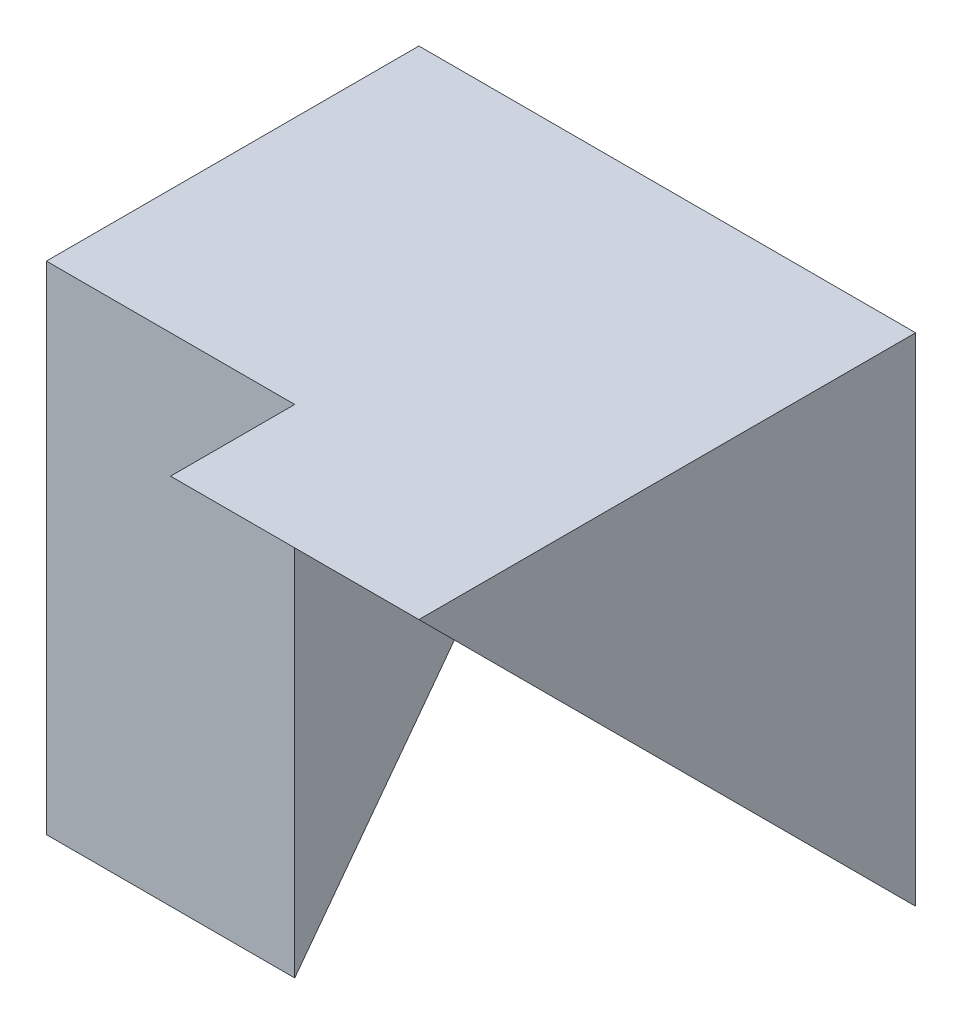
ISO-10303-21;
HEADER;
FILE_DESCRIPTION(('STEP AP214'),'2;1');
FILE_NAME('part.step','',(''),(''),'','','');
FILE_SCHEMA(('AUTOMOTIVE_DESIGN { 1 0 10303 214 1 1 1 1 }'));
ENDSEC;
DATA;
#1=APPLICATION_CONTEXT('core data for automotive mechanical design processes');
#2=APPLICATION_PROTOCOL_DEFINITION('international standard','automotive_design',2000,#1);
#3=PRODUCT_CONTEXT('',#1,'mechanical');
#4=PRODUCT('Part','Part','',(#3));
#5=PRODUCT_RELATED_PRODUCT_CATEGORY('part','',(#4));
#6=PRODUCT_DEFINITION_FORMATION('','',#4);
#7=PRODUCT_DEFINITION_CONTEXT('part definition',#1,'design');
#8=PRODUCT_DEFINITION('design','',#6,#7);
#9=PRODUCT_DEFINITION_SHAPE('','',#8);
#10=(LENGTH_UNIT() NAMED_UNIT(*) SI_UNIT(.MILLI.,.METRE.));
#11=(NAMED_UNIT(*) PLANE_ANGLE_UNIT() SI_UNIT($,.RADIAN.));
#12=(NAMED_UNIT(*) SI_UNIT($,.STERADIAN.) SOLID_ANGLE_UNIT());
#13=UNCERTAINTY_MEASURE_WITH_UNIT(LENGTH_MEASURE(1.E-05),#10,'distance_accuracy_value','');
#14=(GEOMETRIC_REPRESENTATION_CONTEXT(3) GLOBAL_UNCERTAINTY_ASSIGNED_CONTEXT((#13)) GLOBAL_UNIT_ASSIGNED_CONTEXT((#10,
#11,#12)) REPRESENTATION_CONTEXT('',''));
#15=CARTESIAN_POINT('',(0.,0.,0.));
#16=DIRECTION('',(0.,0.,1.));
#17=DIRECTION('',(1.,0.,0.));
#18=AXIS2_PLACEMENT_3D('',#15,#16,#17);
#19=CARTESIAN_POINT('',(2.,0.,-4.));
#20=DIRECTION('',(0.,0.,1.));
#21=DIRECTION('',(1.,0.,0.));
#22=AXIS2_PLACEMENT_3D('',#19,#20,#21);
#23=PLANE('',#22);
#24=DIRECTION('',(0.,-1.,0.));
#25=VECTOR('',#24,1.);
#26=CARTESIAN_POINT('',(0.,0.,-4.));
#27=LINE('',#26,#25);
#28=CARTESIAN_POINT('',(0.,4.,-4.));
#29=VERTEX_POINT('',#28);
#30=CARTESIAN_POINT('',(0.,0.,-4.));
#31=VERTEX_POINT('',#30);
#32=EDGE_CURVE('E99',#29,#31,#27,.T.);
#33=ORIENTED_EDGE('',*,*,#32,.F.);
#34=DIRECTION('',(-1.,0.,0.));
#35=VECTOR('',#34,1.);
#36=CARTESIAN_POINT('',(2.,4.,-4.));
#37=LINE('',#36,#35);
#38=CARTESIAN_POINT('',(2.,4.,-4.));
#39=VERTEX_POINT('',#38);
#40=EDGE_CURVE('E41',#39,#29,#37,.T.);
#41=ORIENTED_EDGE('',*,*,#40,.F.);
#42=DIRECTION('',(0.,1.,0.));
#43=VECTOR('',#42,1.);
#44=CARTESIAN_POINT('',(2.,0.,-4.));
#45=LINE('',#44,#43);
#46=CARTESIAN_POINT('',(2.,0.,-4.));
#47=VERTEX_POINT('',#46);
#48=EDGE_CURVE('E57',#47,#39,#45,.T.);
#49=ORIENTED_EDGE('',*,*,#48,.F.);
#50=DIRECTION('',(-1.,0.,0.));
#51=VECTOR('',#50,1.);
#52=CARTESIAN_POINT('',(2.,0.,-4.));
#53=LINE('',#52,#51);
#54=EDGE_CURVE('E11',#47,#31,#53,.T.);
#55=ORIENTED_EDGE('',*,*,#54,.T.);
#56=EDGE_LOOP('',(#33,#41,#49,#55));
#57=FACE_BOUND('',#56,.T.);
#58=ADVANCED_FACE('F32',(#57),#23,.F.);
#59=CARTESIAN_POINT('',(2.,4.,0.));
#60=DIRECTION('',(0.,-1.,0.));
#61=DIRECTION('',(0.,0.,-1.));
#62=AXIS2_PLACEMENT_3D('',#59,#60,#61);
#63=PLANE('',#62);
#64=ORIENTED_EDGE('',*,*,#40,.T.);
#65=DIRECTION('',(-1.,0.,0.));
#66=VECTOR('',#65,1.);
#67=CARTESIAN_POINT('',(0.,4.,-4.));
#68=LINE('',#67,#66);
#69=CARTESIAN_POINT('',(-2.,4.,-4.));
#70=VERTEX_POINT('',#69);
#71=EDGE_CURVE('E142',#29,#70,#68,.T.);
#72=ORIENTED_EDGE('',*,*,#71,.T.);
#73=DIRECTION('',(0.,0.,-1.));
#74=VECTOR('',#73,1.);
#75=CARTESIAN_POINT('',(-2.,4.,-1.));
#76=LINE('',#75,#74);
#77=CARTESIAN_POINT('',(-2.,4.,-1.));
#78=VERTEX_POINT('',#77);
#79=EDGE_CURVE('E116',#78,#70,#76,.T.);
#80=ORIENTED_EDGE('',*,*,#79,.F.);
#81=DIRECTION('',(1.,0.,0.));
#82=VECTOR('',#81,1.);
#83=CARTESIAN_POINT('',(-2.,4.,-1.));
#84=LINE('',#83,#82);
#85=CARTESIAN_POINT('',(0.,4.,-1.));
#86=VERTEX_POINT('',#85);
#87=EDGE_CURVE('E111',#78,#86,#84,.T.);
#88=ORIENTED_EDGE('',*,*,#87,.T.);
#89=DIRECTION('',(0.,0.,1.));
#90=VECTOR('',#89,1.);
#91=CARTESIAN_POINT('',(0.,4.,0.));
#92=LINE('',#91,#90);
#93=CARTESIAN_POINT('',(0.,4.,0.));
#94=VERTEX_POINT('',#93);
#95=EDGE_CURVE('E110',#86,#94,#92,.T.);
#96=ORIENTED_EDGE('',*,*,#95,.T.);
#97=DIRECTION('',(-1.,0.,0.));
#98=VECTOR('',#97,1.);
#99=CARTESIAN_POINT('',(2.,4.,0.));
#100=LINE('',#99,#98);
#101=CARTESIAN_POINT('',(2.,4.,0.));
#102=VERTEX_POINT('',#101);
#103=EDGE_CURVE('E135',#102,#94,#100,.T.);
#104=ORIENTED_EDGE('',*,*,#103,.F.);
#105=DIRECTION('',(0.,0.,1.));
#106=VECTOR('',#105,1.);
#107=CARTESIAN_POINT('',(2.,4.,0.));
#108=LINE('',#107,#106);
#109=EDGE_CURVE('E134',#39,#102,#108,.T.);
#110=ORIENTED_EDGE('',*,*,#109,.F.);
#111=EDGE_LOOP('',(#64,#72,#80,#88,#96,#104,#110));
#112=FACE_BOUND('',#111,.T.);
#113=ADVANCED_FACE('F140',(#112),#63,.F.);
#114=CARTESIAN_POINT('',(2.,0.,0.));
#115=DIRECTION('',(-1.,0.,0.));
#116=DIRECTION('',(0.,0.,1.));
#117=AXIS2_PLACEMENT_3D('',#114,#115,#116);
#118=PLANE('',#117);
#119=ORIENTED_EDGE('',*,*,#109,.T.);
#120=DIRECTION('',(0.,0.707106781186544,0.707106781186551));
#121=VECTOR('',#120,1.);
#122=CARTESIAN_POINT('',(2.,2.,-1.99999999999998));
#123=LINE('',#122,#121);
#124=EDGE_CURVE('E150',#47,#102,#123,.T.);
#125=ORIENTED_EDGE('',*,*,#124,.F.);
#126=ORIENTED_EDGE('',*,*,#48,.T.);
#127=EDGE_LOOP('',(#119,#125,#126));
#128=FACE_BOUND('',#127,.T.);
#129=ADVANCED_FACE('F167',(#128),#118,.F.);
#130=CARTESIAN_POINT('',(0.,0.,0.));
#131=DIRECTION('',(-1.,0.,0.));
#132=DIRECTION('',(0.,0.,1.));
#133=AXIS2_PLACEMENT_3D('',#130,#131,#132);
#134=PLANE('',#133);
#135=DIRECTION('',(0.,0.707106781186544,0.707106781186551));
#136=VECTOR('',#135,1.);
#137=CARTESIAN_POINT('',(0.,2.,-1.99999999999998));
#138=LINE('',#137,#136);
#139=CARTESIAN_POINT('',(0.,2.99999999999997,-1.));
#140=VERTEX_POINT('',#139);
#141=EDGE_CURVE('E157',#140,#94,#138,.T.);
#142=ORIENTED_EDGE('',*,*,#141,.T.);
#143=ORIENTED_EDGE('',*,*,#95,.F.);
#144=DIRECTION('',(0.,1.,0.));
#145=VECTOR('',#144,1.);
#146=CARTESIAN_POINT('',(0.,0.,-1.));
#147=LINE('',#146,#145);
#148=EDGE_CURVE('E105',#140,#86,#147,.T.);
#149=ORIENTED_EDGE('',*,*,#148,.F.);
#150=EDGE_LOOP('',(#142,#143,#149));
#151=FACE_BOUND('',#150,.T.);
#152=ADVANCED_FACE('F164',(#151),#134,.T.);
#153=CARTESIAN_POINT('',(-2.,0.,-1.));
#154=DIRECTION('',(0.,0.,-1.));
#155=DIRECTION('',(-1.,0.,0.));
#156=AXIS2_PLACEMENT_3D('',#153,#154,#155);
#157=PLANE('',#156);
#158=CARTESIAN_POINT('',(0.,0.,-1.));
#159=VERTEX_POINT('',#158);
#160=EDGE_CURVE('E101',#159,#140,#147,.T.);
#161=ORIENTED_EDGE('',*,*,#160,.T.);
#162=ORIENTED_EDGE('',*,*,#148,.T.);
#163=ORIENTED_EDGE('',*,*,#87,.F.);
#164=DIRECTION('',(0.,1.,0.));
#165=VECTOR('',#164,1.);
#166=CARTESIAN_POINT('',(-2.,0.,-1.));
#167=LINE('',#166,#165);
#168=CARTESIAN_POINT('',(-2.,0.,-1.));
#169=VERTEX_POINT('',#168);
#170=EDGE_CURVE('E104',#169,#78,#167,.T.);
#171=ORIENTED_EDGE('',*,*,#170,.F.);
#172=DIRECTION('',(1.,0.,0.));
#173=VECTOR('',#172,1.);
#174=CARTESIAN_POINT('',(-2.,0.,-1.));
#175=LINE('',#174,#173);
#176=EDGE_CURVE('E95',#169,#159,#175,.T.);
#177=ORIENTED_EDGE('',*,*,#176,.T.);
#178=EDGE_LOOP('',(#161,#162,#163,#171,#177));
#179=FACE_BOUND('',#178,.T.);
#180=ADVANCED_FACE('F108',(#179),#157,.F.);
#181=CARTESIAN_POINT('',(-2.,0.,0.));
#182=DIRECTION('',(-1.,0.,0.));
#183=DIRECTION('',(0.,0.,1.));
#184=AXIS2_PLACEMENT_3D('',#181,#182,#183);
#185=PLANE('',#184);
#186=DIRECTION('',(0.,0.8,-0.6));
#187=VECTOR('',#186,1.);
#188=CARTESIAN_POINT('',(-2.,-0.48,-0.64));
#189=LINE('',#188,#187);
#190=EDGE_CURVE('E154',#169,#70,#189,.T.);
#191=ORIENTED_EDGE('',*,*,#190,.F.);
#192=ORIENTED_EDGE('',*,*,#170,.T.);
#193=ORIENTED_EDGE('',*,*,#79,.T.);
#194=EDGE_LOOP('',(#191,#192,#193));
#195=FACE_BOUND('',#194,.T.);
#196=ADVANCED_FACE('F159',(#195),#185,.T.);
#197=CARTESIAN_POINT('',(0.,0.,0.));
#198=DIRECTION('',(1.,0.,0.));
#199=DIRECTION('',(0.,0.,-1.));
#200=AXIS2_PLACEMENT_3D('',#197,#198,#199);
#201=PLANE('',#200);
#202=DIRECTION('',(0.,0.8,-0.6));
#203=VECTOR('',#202,1.);
#204=CARTESIAN_POINT('',(0.,-0.48,-0.64));
#205=LINE('',#204,#203);
#206=CARTESIAN_POINT('',(0.,1.7142857142857,-2.28571428571428));
#207=VERTEX_POINT('',#206);
#208=EDGE_CURVE('E35',#159,#207,#205,.T.);
#209=ORIENTED_EDGE('',*,*,#208,.T.);
#210=EDGE_CURVE('E49',#207,#140,#138,.T.);
#211=ORIENTED_EDGE('',*,*,#210,.T.);
#212=ORIENTED_EDGE('',*,*,#160,.F.);
#213=EDGE_LOOP('',(#209,#211,#212));
#214=FACE_BOUND('',#213,.T.);
#215=ADVANCED_FACE('F102',(#214),#201,.T.);
#216=CARTESIAN_POINT('',(0.,2.,-1.99999999999998));
#217=DIRECTION('',(0.,0.707106781186551,-0.707106781186544));
#218=DIRECTION('',(0.,0.707106781186544,0.707106781186551));
#219=AXIS2_PLACEMENT_3D('',#216,#217,#218);
#220=PLANE('',#219);
#221=ORIENTED_EDGE('',*,*,#124,.T.);
#222=ORIENTED_EDGE('',*,*,#103,.T.);
#223=ORIENTED_EDGE('',*,*,#141,.F.);
#224=ORIENTED_EDGE('',*,*,#210,.F.);
#225=EDGE_CURVE('E123',#31,#207,#138,.T.);
#226=ORIENTED_EDGE('',*,*,#225,.F.);
#227=ORIENTED_EDGE('',*,*,#54,.F.);
#228=EDGE_LOOP('',(#221,#222,#223,#224,#226,#227));
#229=FACE_BOUND('',#228,.T.);
#230=ADVANCED_FACE('F166',(#229),#220,.F.);
#231=CARTESIAN_POINT('',(0.,0.,0.));
#232=DIRECTION('',(-1.,0.,0.));
#233=DIRECTION('',(0.,0.,1.));
#234=AXIS2_PLACEMENT_3D('',#231,#232,#233);
#235=PLANE('',#234);
#236=ORIENTED_EDGE('',*,*,#225,.T.);
#237=EDGE_CURVE('E98',#207,#29,#205,.T.);
#238=ORIENTED_EDGE('',*,*,#237,.T.);
#239=ORIENTED_EDGE('',*,*,#32,.T.);
#240=EDGE_LOOP('',(#236,#238,#239));
#241=FACE_BOUND('',#240,.T.);
#242=ADVANCED_FACE('F214',(#241),#235,.T.);
#243=CARTESIAN_POINT('',(0.,-0.48,-0.64));
#244=DIRECTION('',(0.,0.6,0.8));
#245=DIRECTION('',(0.,-0.8,0.6));
#246=AXIS2_PLACEMENT_3D('',#243,#244,#245);
#247=PLANE('',#246);
#248=ORIENTED_EDGE('',*,*,#190,.T.);
#249=ORIENTED_EDGE('',*,*,#71,.F.);
#250=ORIENTED_EDGE('',*,*,#237,.F.);
#251=ORIENTED_EDGE('',*,*,#208,.F.);
#252=ORIENTED_EDGE('',*,*,#176,.F.);
#253=EDGE_LOOP('',(#248,#249,#250,#251,#252));
#254=FACE_BOUND('',#253,.T.);
#255=ADVANCED_FACE('F93',(#254),#247,.F.);
#256=CLOSED_SHELL('',(#58,#113,#129,#152,#180,#196,#215,#230,#242,#255));
#257=MANIFOLD_SOLID_BREP('B2',#256);
#258=ADVANCED_BREP_SHAPE_REPRESENTATION('',(#18,#257),#14);
#259=SHAPE_DEFINITION_REPRESENTATION(#9,#258);
ENDSEC;
END-ISO-10303-21;
